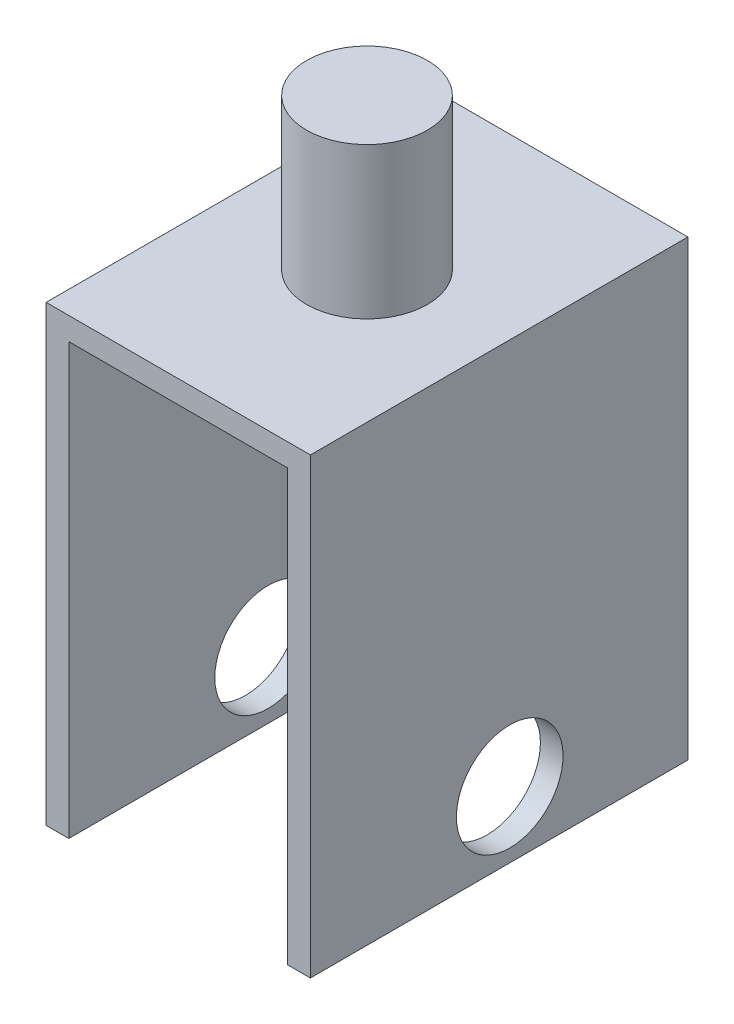
ISO-10303-21;
HEADER;
FILE_DESCRIPTION(('STEP AP214'),'2;1');
FILE_NAME('part.step','',(''),(''),'','','');
FILE_SCHEMA(('AUTOMOTIVE_DESIGN { 1 0 10303 214 1 1 1 1 }'));
ENDSEC;
DATA;
#1=APPLICATION_CONTEXT('core data for automotive mechanical design processes');
#2=APPLICATION_PROTOCOL_DEFINITION('international standard','automotive_design',2000,#1);
#3=PRODUCT_CONTEXT('',#1,'mechanical');
#4=PRODUCT('Part','Part','',(#3));
#5=PRODUCT_RELATED_PRODUCT_CATEGORY('part','',(#4));
#6=PRODUCT_DEFINITION_FORMATION('','',#4);
#7=PRODUCT_DEFINITION_CONTEXT('part definition',#1,'design');
#8=PRODUCT_DEFINITION('design','',#6,#7);
#9=PRODUCT_DEFINITION_SHAPE('','',#8);
#10=(LENGTH_UNIT() NAMED_UNIT(*) SI_UNIT(.MILLI.,.METRE.));
#11=(NAMED_UNIT(*) PLANE_ANGLE_UNIT() SI_UNIT($,.RADIAN.));
#12=(NAMED_UNIT(*) SI_UNIT($,.STERADIAN.) SOLID_ANGLE_UNIT());
#13=UNCERTAINTY_MEASURE_WITH_UNIT(LENGTH_MEASURE(1.E-05),#10,'distance_accuracy_value','');
#14=(GEOMETRIC_REPRESENTATION_CONTEXT(3) GLOBAL_UNCERTAINTY_ASSIGNED_CONTEXT((#13)) GLOBAL_UNIT_ASSIGNED_CONTEXT((#10,
#11,#12)) REPRESENTATION_CONTEXT('',''));
#15=CARTESIAN_POINT('',(0.,0.,0.));
#16=DIRECTION('',(0.,0.,1.));
#17=DIRECTION('',(1.,0.,0.));
#18=AXIS2_PLACEMENT_3D('',#15,#16,#17);
#19=CARTESIAN_POINT('',(17.5,30.,25.));
#20=DIRECTION('',(-1.,0.,0.));
#21=DIRECTION('',(0.,-1.,0.));
#22=AXIS2_PLACEMENT_3D('',#19,#20,#21);
#23=PLANE('',#22);
#24=CARTESIAN_POINT('',(17.5,-21.2315111847368,-1.40325792185786));
#25=DIRECTION('',(-1.,0.,0.));
#26=DIRECTION('',(0.,-1.,0.));
#27=AXIS2_PLACEMENT_3D('',#24,#25,#26);
#28=CIRCLE('',#27,7.06152209912277);
#29=CARTESIAN_POINT('',(17.5,-28.2930332838596,-1.40325792185786));
#30=VERTEX_POINT('',#29);
#31=EDGE_CURVE('E226',#30,#30,#28,.T.);
#32=ORIENTED_EDGE('',*,*,#31,.T.);
#33=EDGE_LOOP('',(#32));
#34=FACE_BOUND('',#33,.T.);
#35=DIRECTION('',(0.,1.,0.));
#36=VECTOR('',#35,1.);
#37=CARTESIAN_POINT('',(17.5,30.,-25.));
#38=LINE('',#37,#36);
#39=CARTESIAN_POINT('',(17.5,-30.,-25.));
#40=VERTEX_POINT('',#39);
#41=CARTESIAN_POINT('',(17.5,30.,-25.));
#42=VERTEX_POINT('',#41);
#43=EDGE_CURVE('E143',#40,#42,#38,.T.);
#44=ORIENTED_EDGE('',*,*,#43,.T.);
#45=DIRECTION('',(0.,0.,-1.));
#46=VECTOR('',#45,1.);
#47=CARTESIAN_POINT('',(17.5,30.,25.));
#48=LINE('',#47,#46);
#49=CARTESIAN_POINT('',(17.5,30.,25.));
#50=VERTEX_POINT('',#49);
#51=EDGE_CURVE('E49',#50,#42,#48,.T.);
#52=ORIENTED_EDGE('',*,*,#51,.F.);
#53=DIRECTION('',(0.,1.,0.));
#54=VECTOR('',#53,1.);
#55=CARTESIAN_POINT('',(17.5,30.,25.));
#56=LINE('',#55,#54);
#57=CARTESIAN_POINT('',(17.5,-30.,25.));
#58=VERTEX_POINT('',#57);
#59=EDGE_CURVE('E166',#58,#50,#56,.T.);
#60=ORIENTED_EDGE('',*,*,#59,.F.);
#61=DIRECTION('',(0.,0.,-1.));
#62=VECTOR('',#61,1.);
#63=CARTESIAN_POINT('',(17.5,-30.,25.));
#64=LINE('',#63,#62);
#65=EDGE_CURVE('E139',#58,#40,#64,.T.);
#66=ORIENTED_EDGE('',*,*,#65,.T.);
#67=EDGE_LOOP('',(#44,#52,#60,#66));
#68=FACE_BOUND('',#67,.T.);
#69=ADVANCED_FACE('F39',(#34,#68),#23,.F.);
#70=CARTESIAN_POINT('',(-17.5,30.,25.));
#71=DIRECTION('',(0.,-1.,0.));
#72=DIRECTION('',(0.,0.,-1.));
#73=AXIS2_PLACEMENT_3D('',#70,#71,#72);
#74=PLANE('',#73);
#75=CARTESIAN_POINT('',(0.,30.,0.));
#76=DIRECTION('',(0.,1.,0.));
#77=DIRECTION('',(0.,0.,1.));
#78=AXIS2_PLACEMENT_3D('',#75,#76,#77);
#79=CIRCLE('',#78,8.);
#80=CARTESIAN_POINT('',(0.,30.,8.));
#81=VERTEX_POINT('',#80);
#82=EDGE_CURVE('E11',#81,#81,#79,.T.);
#83=ORIENTED_EDGE('',*,*,#82,.F.);
#84=EDGE_LOOP('',(#83));
#85=FACE_BOUND('',#84,.T.);
#86=DIRECTION('',(-1.,0.,0.));
#87=VECTOR('',#86,1.);
#88=CARTESIAN_POINT('',(-17.5,30.,-25.));
#89=LINE('',#88,#87);
#90=CARTESIAN_POINT('',(-17.5,30.,-25.));
#91=VERTEX_POINT('',#90);
#92=EDGE_CURVE('E147',#42,#91,#89,.T.);
#93=ORIENTED_EDGE('',*,*,#92,.T.);
#94=DIRECTION('',(0.,0.,-1.));
#95=VECTOR('',#94,1.);
#96=CARTESIAN_POINT('',(-17.5,30.,25.));
#97=LINE('',#96,#95);
#98=CARTESIAN_POINT('',(-17.5,30.,25.));
#99=VERTEX_POINT('',#98);
#100=EDGE_CURVE('E181',#99,#91,#97,.T.);
#101=ORIENTED_EDGE('',*,*,#100,.F.);
#102=DIRECTION('',(-1.,0.,0.));
#103=VECTOR('',#102,1.);
#104=CARTESIAN_POINT('',(-17.5,30.,25.));
#105=LINE('',#104,#103);
#106=EDGE_CURVE('E102',#50,#99,#105,.T.);
#107=ORIENTED_EDGE('',*,*,#106,.F.);
#108=ORIENTED_EDGE('',*,*,#51,.T.);
#109=EDGE_LOOP('',(#93,#101,#107,#108));
#110=FACE_BOUND('',#109,.T.);
#111=ADVANCED_FACE('F186',(#85,#110),#74,.F.);
#112=CARTESIAN_POINT('',(-17.5,30.,25.));
#113=DIRECTION('',(1.,0.,0.));
#114=DIRECTION('',(0.,1.,0.));
#115=AXIS2_PLACEMENT_3D('',#112,#113,#114);
#116=PLANE('',#115);
#117=CARTESIAN_POINT('',(-17.5,-21.2315111847368,-1.40325792185786));
#118=DIRECTION('',(-1.,0.,0.));
#119=DIRECTION('',(0.,-1.,0.));
#120=AXIS2_PLACEMENT_3D('',#117,#118,#119);
#121=CIRCLE('',#120,7.06152209912277);
#122=CARTESIAN_POINT('',(-17.5,-28.2930332838596,-1.40325792185786));
#123=VERTEX_POINT('',#122);
#124=EDGE_CURVE('E222',#123,#123,#121,.T.);
#125=ORIENTED_EDGE('',*,*,#124,.F.);
#126=EDGE_LOOP('',(#125));
#127=FACE_BOUND('',#126,.T.);
#128=DIRECTION('',(0.,-1.,0.));
#129=VECTOR('',#128,1.);
#130=CARTESIAN_POINT('',(-17.5,30.,-25.));
#131=LINE('',#130,#129);
#132=CARTESIAN_POINT('',(-17.5,-30.,-25.));
#133=VERTEX_POINT('',#132);
#134=EDGE_CURVE('E151',#91,#133,#131,.T.);
#135=ORIENTED_EDGE('',*,*,#134,.T.);
#136=DIRECTION('',(0.,0.,-1.));
#137=VECTOR('',#136,1.);
#138=CARTESIAN_POINT('',(-17.5,-30.,25.));
#139=LINE('',#138,#137);
#140=CARTESIAN_POINT('',(-17.5,-30.,25.));
#141=VERTEX_POINT('',#140);
#142=EDGE_CURVE('E177',#141,#133,#139,.T.);
#143=ORIENTED_EDGE('',*,*,#142,.F.);
#144=DIRECTION('',(0.,-1.,0.));
#145=VECTOR('',#144,1.);
#146=CARTESIAN_POINT('',(-17.5,30.,25.));
#147=LINE('',#146,#145);
#148=EDGE_CURVE('E205',#99,#141,#147,.T.);
#149=ORIENTED_EDGE('',*,*,#148,.F.);
#150=ORIENTED_EDGE('',*,*,#100,.T.);
#151=EDGE_LOOP('',(#135,#143,#149,#150));
#152=FACE_BOUND('',#151,.T.);
#153=ADVANCED_FACE('F197',(#127,#152),#116,.F.);
#154=CARTESIAN_POINT('',(-17.5,-30.,25.));
#155=DIRECTION('',(0.,1.,0.));
#156=DIRECTION('',(0.,0.,1.));
#157=AXIS2_PLACEMENT_3D('',#154,#155,#156);
#158=PLANE('',#157);
#159=DIRECTION('',(1.,0.,0.));
#160=VECTOR('',#159,1.);
#161=CARTESIAN_POINT('',(-17.5,-30.,-25.));
#162=LINE('',#161,#160);
#163=CARTESIAN_POINT('',(-14.5,-30.,-25.));
#164=VERTEX_POINT('',#163);
#165=EDGE_CURVE('E154',#133,#164,#162,.T.);
#166=ORIENTED_EDGE('',*,*,#165,.T.);
#167=DIRECTION('',(0.,0.,-1.));
#168=VECTOR('',#167,1.);
#169=CARTESIAN_POINT('',(-14.5,-30.,25.));
#170=LINE('',#169,#168);
#171=CARTESIAN_POINT('',(-14.5,-30.,25.));
#172=VERTEX_POINT('',#171);
#173=EDGE_CURVE('E173',#172,#164,#170,.T.);
#174=ORIENTED_EDGE('',*,*,#173,.F.);
#175=DIRECTION('',(1.,0.,0.));
#176=VECTOR('',#175,1.);
#177=CARTESIAN_POINT('',(-17.5,-30.,25.));
#178=LINE('',#177,#176);
#179=EDGE_CURVE('E203',#141,#172,#178,.T.);
#180=ORIENTED_EDGE('',*,*,#179,.F.);
#181=ORIENTED_EDGE('',*,*,#142,.T.);
#182=EDGE_LOOP('',(#166,#174,#180,#181));
#183=FACE_BOUND('',#182,.T.);
#184=ADVANCED_FACE('F201',(#183),#158,.F.);
#185=CARTESIAN_POINT('',(-14.5,-30.,25.));
#186=DIRECTION('',(-1.,0.,0.));
#187=DIRECTION('',(0.,0.,1.));
#188=AXIS2_PLACEMENT_3D('',#185,#186,#187);
#189=PLANE('',#188);
#190=CARTESIAN_POINT('',(-14.5,-21.2315111847368,-1.40325792185786));
#191=DIRECTION('',(-1.,0.,0.));
#192=DIRECTION('',(0.,0.,1.));
#193=AXIS2_PLACEMENT_3D('',#190,#191,#192);
#194=CIRCLE('',#193,7.06152209912277);
#195=CARTESIAN_POINT('',(-14.5,-21.2315111847368,5.65826417726491));
#196=VERTEX_POINT('',#195);
#197=EDGE_CURVE('E218',#196,#196,#194,.T.);
#198=ORIENTED_EDGE('',*,*,#197,.T.);
#199=EDGE_LOOP('',(#198));
#200=FACE_BOUND('',#199,.T.);
#201=DIRECTION('',(0.,1.,0.));
#202=VECTOR('',#201,1.);
#203=CARTESIAN_POINT('',(-14.5,-30.,-25.));
#204=LINE('',#203,#202);
#205=CARTESIAN_POINT('',(-14.5,27.,-25.));
#206=VERTEX_POINT('',#205);
#207=EDGE_CURVE('E157',#164,#206,#204,.T.);
#208=ORIENTED_EDGE('',*,*,#207,.T.);
#209=DIRECTION('',(0.,0.,-1.));
#210=VECTOR('',#209,1.);
#211=CARTESIAN_POINT('',(-14.5,27.,25.));
#212=LINE('',#211,#210);
#213=CARTESIAN_POINT('',(-14.5,27.,25.));
#214=VERTEX_POINT('',#213);
#215=EDGE_CURVE('E132',#214,#206,#212,.T.);
#216=ORIENTED_EDGE('',*,*,#215,.F.);
#217=DIRECTION('',(0.,1.,0.));
#218=VECTOR('',#217,1.);
#219=CARTESIAN_POINT('',(-14.5,-30.,25.));
#220=LINE('',#219,#218);
#221=EDGE_CURVE('E121',#172,#214,#220,.T.);
#222=ORIENTED_EDGE('',*,*,#221,.F.);
#223=ORIENTED_EDGE('',*,*,#173,.T.);
#224=EDGE_LOOP('',(#208,#216,#222,#223));
#225=FACE_BOUND('',#224,.T.);
#226=ADVANCED_FACE('F264',(#200,#225),#189,.F.);
#227=CARTESIAN_POINT('',(-14.5,27.,25.));
#228=DIRECTION('',(0.,1.,0.));
#229=DIRECTION('',(0.,0.,1.));
#230=AXIS2_PLACEMENT_3D('',#227,#228,#229);
#231=PLANE('',#230);
#232=DIRECTION('',(1.,0.,0.));
#233=VECTOR('',#232,1.);
#234=CARTESIAN_POINT('',(-14.5,27.,-25.));
#235=LINE('',#234,#233);
#236=CARTESIAN_POINT('',(14.5,27.,-25.));
#237=VERTEX_POINT('',#236);
#238=EDGE_CURVE('E130',#206,#237,#235,.T.);
#239=ORIENTED_EDGE('',*,*,#238,.T.);
#240=DIRECTION('',(0.,0.,-1.));
#241=VECTOR('',#240,1.);
#242=CARTESIAN_POINT('',(14.5,27.,25.));
#243=LINE('',#242,#241);
#244=CARTESIAN_POINT('',(14.5,27.,25.));
#245=VERTEX_POINT('',#244);
#246=EDGE_CURVE('E127',#245,#237,#243,.T.);
#247=ORIENTED_EDGE('',*,*,#246,.F.);
#248=DIRECTION('',(1.,0.,0.));
#249=VECTOR('',#248,1.);
#250=CARTESIAN_POINT('',(-14.5,27.,25.));
#251=LINE('',#250,#249);
#252=EDGE_CURVE('E115',#214,#245,#251,.T.);
#253=ORIENTED_EDGE('',*,*,#252,.F.);
#254=ORIENTED_EDGE('',*,*,#215,.T.);
#255=EDGE_LOOP('',(#239,#247,#253,#254));
#256=FACE_BOUND('',#255,.T.);
#257=ADVANCED_FACE('F128',(#256),#231,.F.);
#258=CARTESIAN_POINT('',(14.5,-30.,25.));
#259=DIRECTION('',(1.,0.,0.));
#260=DIRECTION('',(0.,0.,-1.));
#261=AXIS2_PLACEMENT_3D('',#258,#259,#260);
#262=PLANE('',#261);
#263=CARTESIAN_POINT('',(14.5,-21.2315111847368,-1.40325792185786));
#264=DIRECTION('',(1.,0.,0.));
#265=DIRECTION('',(0.,0.,-1.));
#266=AXIS2_PLACEMENT_3D('',#263,#264,#265);
#267=CIRCLE('',#266,7.06152209912277);
#268=CARTESIAN_POINT('',(14.5,-21.2315111847368,-8.46478002098062));
#269=VERTEX_POINT('',#268);
#270=EDGE_CURVE('E42',#269,#269,#267,.T.);
#271=ORIENTED_EDGE('',*,*,#270,.T.);
#272=EDGE_LOOP('',(#271));
#273=FACE_BOUND('',#272,.T.);
#274=DIRECTION('',(0.,-1.,0.));
#275=VECTOR('',#274,1.);
#276=CARTESIAN_POINT('',(14.5,-30.,-25.));
#277=LINE('',#276,#275);
#278=CARTESIAN_POINT('',(14.5,-30.,-25.));
#279=VERTEX_POINT('',#278);
#280=EDGE_CURVE('E87',#237,#279,#277,.T.);
#281=ORIENTED_EDGE('',*,*,#280,.T.);
#282=DIRECTION('',(0.,0.,-1.));
#283=VECTOR('',#282,1.);
#284=CARTESIAN_POINT('',(14.5,-30.,25.));
#285=LINE('',#284,#283);
#286=CARTESIAN_POINT('',(14.5,-30.,25.));
#287=VERTEX_POINT('',#286);
#288=EDGE_CURVE('E133',#287,#279,#285,.T.);
#289=ORIENTED_EDGE('',*,*,#288,.F.);
#290=DIRECTION('',(0.,-1.,0.));
#291=VECTOR('',#290,1.);
#292=CARTESIAN_POINT('',(14.5,-30.,25.));
#293=LINE('',#292,#291);
#294=EDGE_CURVE('E119',#245,#287,#293,.T.);
#295=ORIENTED_EDGE('',*,*,#294,.F.);
#296=ORIENTED_EDGE('',*,*,#246,.T.);
#297=EDGE_LOOP('',(#281,#289,#295,#296));
#298=FACE_BOUND('',#297,.T.);
#299=ADVANCED_FACE('F135',(#273,#298),#262,.F.);
#300=CARTESIAN_POINT('',(14.5,-30.,25.));
#301=DIRECTION('',(0.,1.,0.));
#302=DIRECTION('',(0.,0.,1.));
#303=AXIS2_PLACEMENT_3D('',#300,#301,#302);
#304=PLANE('',#303);
#305=DIRECTION('',(1.,0.,0.));
#306=VECTOR('',#305,1.);
#307=CARTESIAN_POINT('',(14.5,-30.,-25.));
#308=LINE('',#307,#306);
#309=EDGE_CURVE('E93',#279,#40,#308,.T.);
#310=ORIENTED_EDGE('',*,*,#309,.T.);
#311=ORIENTED_EDGE('',*,*,#65,.F.);
#312=DIRECTION('',(1.,0.,0.));
#313=VECTOR('',#312,1.);
#314=CARTESIAN_POINT('',(14.5,-30.,25.));
#315=LINE('',#314,#313);
#316=EDGE_CURVE('E58',#287,#58,#315,.T.);
#317=ORIENTED_EDGE('',*,*,#316,.F.);
#318=ORIENTED_EDGE('',*,*,#288,.T.);
#319=EDGE_LOOP('',(#310,#311,#317,#318));
#320=FACE_BOUND('',#319,.T.);
#321=ADVANCED_FACE('F272',(#320),#304,.F.);
#322=CARTESIAN_POINT('',(0.,0.,25.));
#323=DIRECTION('',(0.,0.,1.));
#324=DIRECTION('',(1.,0.,0.));
#325=AXIS2_PLACEMENT_3D('',#322,#323,#324);
#326=PLANE('',#325);
#327=ORIENTED_EDGE('',*,*,#59,.T.);
#328=ORIENTED_EDGE('',*,*,#106,.T.);
#329=ORIENTED_EDGE('',*,*,#148,.T.);
#330=ORIENTED_EDGE('',*,*,#179,.T.);
#331=ORIENTED_EDGE('',*,*,#221,.T.);
#332=ORIENTED_EDGE('',*,*,#252,.T.);
#333=ORIENTED_EDGE('',*,*,#294,.T.);
#334=ORIENTED_EDGE('',*,*,#316,.T.);
#335=EDGE_LOOP('',(#327,#328,#329,#330,#331,#332,#333,#334));
#336=FACE_BOUND('',#335,.T.);
#337=ADVANCED_FACE('F117',(#336),#326,.T.);
#338=CARTESIAN_POINT('',(0.,0.,-25.));
#339=DIRECTION('',(0.,0.,1.));
#340=DIRECTION('',(1.,0.,0.));
#341=AXIS2_PLACEMENT_3D('',#338,#339,#340);
#342=PLANE('',#341);
#343=ORIENTED_EDGE('',*,*,#43,.F.);
#344=ORIENTED_EDGE('',*,*,#309,.F.);
#345=ORIENTED_EDGE('',*,*,#280,.F.);
#346=ORIENTED_EDGE('',*,*,#238,.F.);
#347=ORIENTED_EDGE('',*,*,#207,.F.);
#348=ORIENTED_EDGE('',*,*,#165,.F.);
#349=ORIENTED_EDGE('',*,*,#134,.F.);
#350=ORIENTED_EDGE('',*,*,#92,.F.);
#351=EDGE_LOOP('',(#343,#344,#345,#346,#347,#348,#349,#350));
#352=FACE_BOUND('',#351,.T.);
#353=ADVANCED_FACE('F191',(#352),#342,.F.);
#354=CARTESIAN_POINT('',(0.,50.,0.));
#355=DIRECTION('',(0.,-1.,0.));
#356=DIRECTION('',(0.,0.,-1.));
#357=AXIS2_PLACEMENT_3D('',#354,#355,#356);
#358=CYLINDRICAL_SURFACE('',#357,8.);
#359=CARTESIAN_POINT('',(0.,50.,0.));
#360=DIRECTION('',(0.,1.,0.));
#361=DIRECTION('',(0.,0.,1.));
#362=AXIS2_PLACEMENT_3D('',#359,#360,#361);
#363=CIRCLE('',#362,8.);
#364=CARTESIAN_POINT('',(0.,50.,8.));
#365=VERTEX_POINT('',#364);
#366=EDGE_CURVE('E148',#365,#365,#363,.T.);
#367=ORIENTED_EDGE('',*,*,#366,.F.);
#368=EDGE_LOOP('',(#367));
#369=FACE_BOUND('',#368,.T.);
#370=ORIENTED_EDGE('',*,*,#82,.T.);
#371=EDGE_LOOP('',(#370));
#372=FACE_BOUND('',#371,.T.);
#373=ADVANCED_FACE('F247',(#369,#372),#358,.T.);
#374=CARTESIAN_POINT('',(0.,50.,0.));
#375=DIRECTION('',(0.,1.,0.));
#376=DIRECTION('',(0.,0.,1.));
#377=AXIS2_PLACEMENT_3D('',#374,#375,#376);
#378=PLANE('',#377);
#379=ORIENTED_EDGE('',*,*,#366,.T.);
#380=EDGE_LOOP('',(#379));
#381=FACE_BOUND('',#380,.T.);
#382=ADVANCED_FACE('F239',(#381),#378,.T.);
#383=CARTESIAN_POINT('',(17.5,-21.2315111847368,-1.40325792185786));
#384=DIRECTION('',(-1.,0.,0.));
#385=DIRECTION('',(0.,-1.,0.));
#386=AXIS2_PLACEMENT_3D('',#383,#384,#385);
#387=CYLINDRICAL_SURFACE('',#386,7.06152209912277);
#388=ORIENTED_EDGE('',*,*,#31,.F.);
#389=EDGE_LOOP('',(#388));
#390=FACE_BOUND('',#389,.T.);
#391=ORIENTED_EDGE('',*,*,#270,.F.);
#392=EDGE_LOOP('',(#391));
#393=FACE_BOUND('',#392,.T.);
#394=ADVANCED_FACE('F236',(#390,#393),#387,.F.);
#395=ORIENTED_EDGE('',*,*,#124,.T.);
#396=EDGE_LOOP('',(#395));
#397=FACE_BOUND('',#396,.T.);
#398=ORIENTED_EDGE('',*,*,#197,.F.);
#399=EDGE_LOOP('',(#398));
#400=FACE_BOUND('',#399,.T.);
#401=ADVANCED_FACE('F238',(#397,#400),#387,.F.);
#402=CLOSED_SHELL('',(#69,#111,#153,#184,#226,#257,#299,#321,#337,#353,#373,#382,#394,#401));
#403=MANIFOLD_SOLID_BREP('B2',#402);
#404=ADVANCED_BREP_SHAPE_REPRESENTATION('',(#18,#403),#14);
#405=SHAPE_DEFINITION_REPRESENTATION(#9,#404);
ENDSEC;
END-ISO-10303-21;
